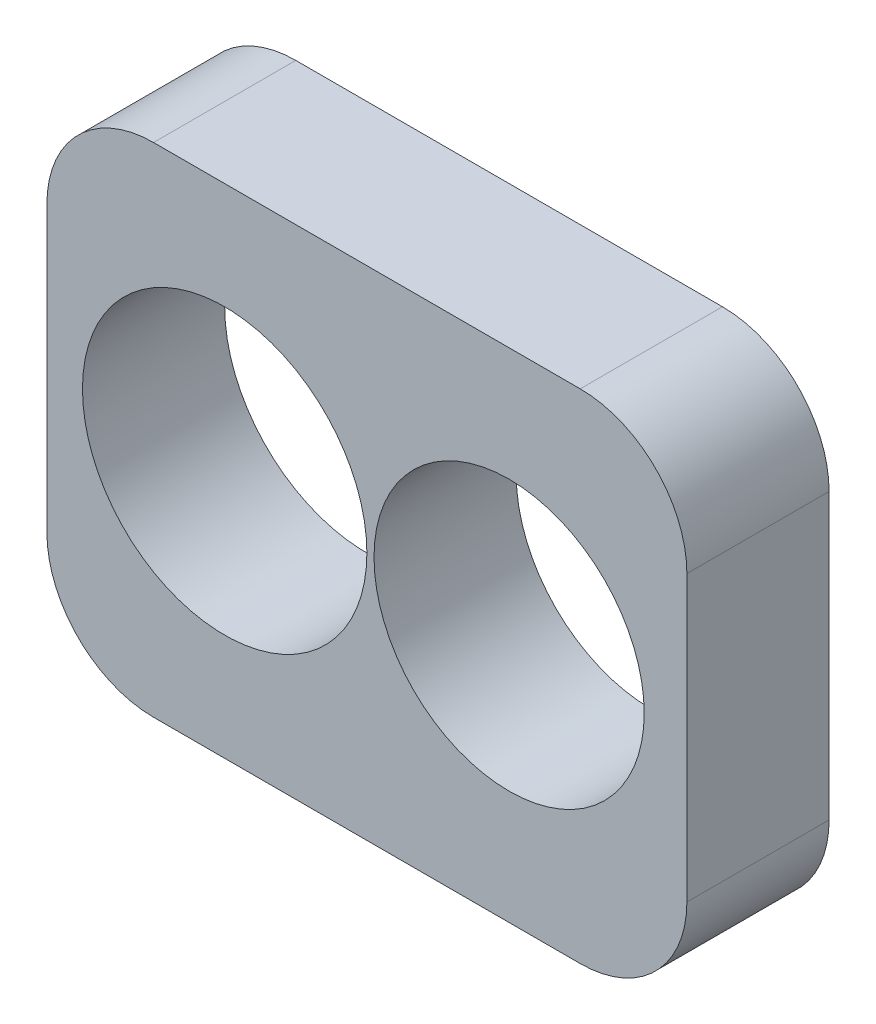
ISO-10303-21;
HEADER;
FILE_DESCRIPTION(('STEP AP214'),'2;1');
FILE_NAME('part.step','',(''),(''),'','','');
FILE_SCHEMA(('AUTOMOTIVE_DESIGN { 1 0 10303 214 1 1 1 1 }'));
ENDSEC;
DATA;
#1=APPLICATION_CONTEXT('core data for automotive mechanical design processes');
#2=APPLICATION_PROTOCOL_DEFINITION('international standard','automotive_design',2000,#1);
#3=PRODUCT_CONTEXT('',#1,'mechanical');
#4=PRODUCT('Part','Part','',(#3));
#5=PRODUCT_RELATED_PRODUCT_CATEGORY('part','',(#4));
#6=PRODUCT_DEFINITION_FORMATION('','',#4);
#7=PRODUCT_DEFINITION_CONTEXT('part definition',#1,'design');
#8=PRODUCT_DEFINITION('design','',#6,#7);
#9=PRODUCT_DEFINITION_SHAPE('','',#8);
#10=(LENGTH_UNIT() NAMED_UNIT(*) SI_UNIT(.MILLI.,.METRE.));
#11=(NAMED_UNIT(*) PLANE_ANGLE_UNIT() SI_UNIT($,.RADIAN.));
#12=(NAMED_UNIT(*) SI_UNIT($,.STERADIAN.) SOLID_ANGLE_UNIT());
#13=UNCERTAINTY_MEASURE_WITH_UNIT(LENGTH_MEASURE(1.E-05),#10,'distance_accuracy_value','');
#14=(GEOMETRIC_REPRESENTATION_CONTEXT(3) GLOBAL_UNCERTAINTY_ASSIGNED_CONTEXT((#13)) GLOBAL_UNIT_ASSIGNED_CONTEXT((#10,
#11,#12)) REPRESENTATION_CONTEXT('',''));
#15=CARTESIAN_POINT('',(0.,0.,0.));
#16=DIRECTION('',(0.,0.,1.));
#17=DIRECTION('',(1.,0.,0.));
#18=AXIS2_PLACEMENT_3D('',#15,#16,#17);
#19=CARTESIAN_POINT('',(-30.,-20.,20.));
#20=DIRECTION('',(0.,0.,-1.));
#21=DIRECTION('',(-1.,0.,0.));
#22=AXIS2_PLACEMENT_3D('',#19,#20,#21);
#23=CYLINDRICAL_SURFACE('',#22,15.);
#24=CARTESIAN_POINT('',(-30.,-20.,0.));
#25=DIRECTION('',(0.,0.,1.));
#26=DIRECTION('',(-1.,0.,0.));
#27=AXIS2_PLACEMENT_3D('',#24,#25,#26);
#28=CIRCLE('',#27,15.);
#29=CARTESIAN_POINT('',(-45.,-20.,0.));
#30=VERTEX_POINT('',#29);
#31=CARTESIAN_POINT('',(-30.,-35.,0.));
#32=VERTEX_POINT('',#31);
#33=EDGE_CURVE('E129',#30,#32,#28,.T.);
#34=ORIENTED_EDGE('',*,*,#33,.T.);
#35=DIRECTION('',(0.,0.,-1.));
#36=VECTOR('',#35,1.);
#37=CARTESIAN_POINT('',(-30.,-35.,20.));
#38=LINE('',#37,#36);
#39=CARTESIAN_POINT('',(-30.,-35.,20.));
#40=VERTEX_POINT('',#39);
#41=EDGE_CURVE('E11',#40,#32,#38,.T.);
#42=ORIENTED_EDGE('',*,*,#41,.F.);
#43=CARTESIAN_POINT('',(-30.,-20.,20.));
#44=DIRECTION('',(0.,0.,1.));
#45=DIRECTION('',(-1.,0.,0.));
#46=AXIS2_PLACEMENT_3D('',#43,#44,#45);
#47=CIRCLE('',#46,15.);
#48=CARTESIAN_POINT('',(-45.,-20.,20.));
#49=VERTEX_POINT('',#48);
#50=EDGE_CURVE('E144',#49,#40,#47,.T.);
#51=ORIENTED_EDGE('',*,*,#50,.F.);
#52=DIRECTION('',(0.,0.,-1.));
#53=VECTOR('',#52,1.);
#54=CARTESIAN_POINT('',(-45.,-20.,20.));
#55=LINE('',#54,#53);
#56=EDGE_CURVE('E125',#49,#30,#55,.T.);
#57=ORIENTED_EDGE('',*,*,#56,.T.);
#58=EDGE_LOOP('',(#34,#42,#51,#57));
#59=FACE_BOUND('',#58,.T.);
#60=ADVANCED_FACE('F33',(#59),#23,.T.);
#61=CARTESIAN_POINT('',(30.,-35.,20.));
#62=DIRECTION('',(0.,1.,0.));
#63=DIRECTION('',(-1.,0.,0.));
#64=AXIS2_PLACEMENT_3D('',#61,#62,#63);
#65=PLANE('',#64);
#66=DIRECTION('',(1.,0.,0.));
#67=VECTOR('',#66,1.);
#68=CARTESIAN_POINT('',(30.,-35.,0.));
#69=LINE('',#68,#67);
#70=CARTESIAN_POINT('',(30.,-35.,0.));
#71=VERTEX_POINT('',#70);
#72=EDGE_CURVE('E132',#32,#71,#69,.T.);
#73=ORIENTED_EDGE('',*,*,#72,.T.);
#74=DIRECTION('',(0.,0.,-1.));
#75=VECTOR('',#74,1.);
#76=CARTESIAN_POINT('',(30.,-35.,20.));
#77=LINE('',#76,#75);
#78=CARTESIAN_POINT('',(30.,-35.,20.));
#79=VERTEX_POINT('',#78);
#80=EDGE_CURVE('E41',#79,#71,#77,.T.);
#81=ORIENTED_EDGE('',*,*,#80,.F.);
#82=DIRECTION('',(1.,0.,0.));
#83=VECTOR('',#82,1.);
#84=CARTESIAN_POINT('',(30.,-35.,20.));
#85=LINE('',#84,#83);
#86=EDGE_CURVE('E92',#40,#79,#85,.T.);
#87=ORIENTED_EDGE('',*,*,#86,.F.);
#88=ORIENTED_EDGE('',*,*,#41,.T.);
#89=EDGE_LOOP('',(#73,#81,#87,#88));
#90=FACE_BOUND('',#89,.T.);
#91=ADVANCED_FACE('F213',(#90),#65,.F.);
#92=CARTESIAN_POINT('',(30.,-20.,20.));
#93=DIRECTION('',(0.,0.,-1.));
#94=DIRECTION('',(-1.,0.,0.));
#95=AXIS2_PLACEMENT_3D('',#92,#93,#94);
#96=CYLINDRICAL_SURFACE('',#95,15.);
#97=CARTESIAN_POINT('',(30.,-20.,0.));
#98=DIRECTION('',(0.,0.,1.));
#99=DIRECTION('',(1.,0.,0.));
#100=AXIS2_PLACEMENT_3D('',#97,#98,#99);
#101=CIRCLE('',#100,15.);
#102=CARTESIAN_POINT('',(45.,-20.,0.));
#103=VERTEX_POINT('',#102);
#104=EDGE_CURVE('E135',#71,#103,#101,.T.);
#105=ORIENTED_EDGE('',*,*,#104,.T.);
#106=DIRECTION('',(0.,0.,-1.));
#107=VECTOR('',#106,1.);
#108=CARTESIAN_POINT('',(45.,-20.,20.));
#109=LINE('',#108,#107);
#110=CARTESIAN_POINT('',(45.,-20.,20.));
#111=VERTEX_POINT('',#110);
#112=EDGE_CURVE('E151',#111,#103,#109,.T.);
#113=ORIENTED_EDGE('',*,*,#112,.F.);
#114=CARTESIAN_POINT('',(30.,-20.,20.));
#115=DIRECTION('',(0.,0.,1.));
#116=DIRECTION('',(1.,0.,0.));
#117=AXIS2_PLACEMENT_3D('',#114,#115,#116);
#118=CIRCLE('',#117,15.);
#119=EDGE_CURVE('E159',#79,#111,#118,.T.);
#120=ORIENTED_EDGE('',*,*,#119,.F.);
#121=ORIENTED_EDGE('',*,*,#80,.T.);
#122=EDGE_LOOP('',(#105,#113,#120,#121));
#123=FACE_BOUND('',#122,.T.);
#124=ADVANCED_FACE('F157',(#123),#96,.T.);
#125=CARTESIAN_POINT('',(45.,-20.,20.));
#126=DIRECTION('',(-1.,0.,0.));
#127=DIRECTION('',(0.,-1.,0.));
#128=AXIS2_PLACEMENT_3D('',#125,#126,#127);
#129=PLANE('',#128);
#130=DIRECTION('',(0.,1.,0.));
#131=VECTOR('',#130,1.);
#132=CARTESIAN_POINT('',(45.,-20.,0.));
#133=LINE('',#132,#131);
#134=CARTESIAN_POINT('',(45.,20.,0.));
#135=VERTEX_POINT('',#134);
#136=EDGE_CURVE('E137',#103,#135,#133,.T.);
#137=ORIENTED_EDGE('',*,*,#136,.T.);
#138=DIRECTION('',(0.,0.,-1.));
#139=VECTOR('',#138,1.);
#140=CARTESIAN_POINT('',(45.,20.,20.));
#141=LINE('',#140,#139);
#142=CARTESIAN_POINT('',(45.,20.,20.));
#143=VERTEX_POINT('',#142);
#144=EDGE_CURVE('E148',#143,#135,#141,.T.);
#145=ORIENTED_EDGE('',*,*,#144,.F.);
#146=DIRECTION('',(0.,1.,0.));
#147=VECTOR('',#146,1.);
#148=CARTESIAN_POINT('',(45.,-20.,20.));
#149=LINE('',#148,#147);
#150=EDGE_CURVE('E171',#111,#143,#149,.T.);
#151=ORIENTED_EDGE('',*,*,#150,.F.);
#152=ORIENTED_EDGE('',*,*,#112,.T.);
#153=EDGE_LOOP('',(#137,#145,#151,#152));
#154=FACE_BOUND('',#153,.T.);
#155=ADVANCED_FACE('F167',(#154),#129,.F.);
#156=CARTESIAN_POINT('',(30.,20.,20.));
#157=DIRECTION('',(0.,0.,-1.));
#158=DIRECTION('',(-1.,0.,0.));
#159=AXIS2_PLACEMENT_3D('',#156,#157,#158);
#160=CYLINDRICAL_SURFACE('',#159,15.);
#161=CARTESIAN_POINT('',(30.,20.,0.));
#162=DIRECTION('',(0.,0.,1.));
#163=DIRECTION('',(1.,0.,0.));
#164=AXIS2_PLACEMENT_3D('',#161,#162,#163);
#165=CIRCLE('',#164,15.);
#166=CARTESIAN_POINT('',(30.,35.,0.));
#167=VERTEX_POINT('',#166);
#168=EDGE_CURVE('E139',#135,#167,#165,.T.);
#169=ORIENTED_EDGE('',*,*,#168,.T.);
#170=DIRECTION('',(0.,0.,-1.));
#171=VECTOR('',#170,1.);
#172=CARTESIAN_POINT('',(30.,35.,20.));
#173=LINE('',#172,#171);
#174=CARTESIAN_POINT('',(30.,35.,20.));
#175=VERTEX_POINT('',#174);
#176=EDGE_CURVE('E120',#175,#167,#173,.T.);
#177=ORIENTED_EDGE('',*,*,#176,.F.);
#178=CARTESIAN_POINT('',(30.,20.,20.));
#179=DIRECTION('',(0.,0.,1.));
#180=DIRECTION('',(1.,0.,0.));
#181=AXIS2_PLACEMENT_3D('',#178,#179,#180);
#182=CIRCLE('',#181,15.);
#183=EDGE_CURVE('E111',#143,#175,#182,.T.);
#184=ORIENTED_EDGE('',*,*,#183,.F.);
#185=ORIENTED_EDGE('',*,*,#144,.T.);
#186=EDGE_LOOP('',(#169,#177,#184,#185));
#187=FACE_BOUND('',#186,.T.);
#188=ADVANCED_FACE('F170',(#187),#160,.T.);
#189=CARTESIAN_POINT('',(30.,35.,20.));
#190=DIRECTION('',(0.,-1.,0.));
#191=DIRECTION('',(0.,0.,-1.));
#192=AXIS2_PLACEMENT_3D('',#189,#190,#191);
#193=PLANE('',#192);
#194=DIRECTION('',(-1.,0.,0.));
#195=VECTOR('',#194,1.);
#196=CARTESIAN_POINT('',(30.,35.,0.));
#197=LINE('',#196,#195);
#198=CARTESIAN_POINT('',(-30.,35.,0.));
#199=VERTEX_POINT('',#198);
#200=EDGE_CURVE('E119',#167,#199,#197,.T.);
#201=ORIENTED_EDGE('',*,*,#200,.T.);
#202=DIRECTION('',(0.,0.,-1.));
#203=VECTOR('',#202,1.);
#204=CARTESIAN_POINT('',(-30.,35.,20.));
#205=LINE('',#204,#203);
#206=CARTESIAN_POINT('',(-30.,35.,20.));
#207=VERTEX_POINT('',#206);
#208=EDGE_CURVE('E116',#207,#199,#205,.T.);
#209=ORIENTED_EDGE('',*,*,#208,.F.);
#210=DIRECTION('',(-1.,0.,0.));
#211=VECTOR('',#210,1.);
#212=CARTESIAN_POINT('',(30.,35.,20.));
#213=LINE('',#212,#211);
#214=EDGE_CURVE('E105',#175,#207,#213,.T.);
#215=ORIENTED_EDGE('',*,*,#214,.F.);
#216=ORIENTED_EDGE('',*,*,#176,.T.);
#217=EDGE_LOOP('',(#201,#209,#215,#216));
#218=FACE_BOUND('',#217,.T.);
#219=ADVANCED_FACE('F117',(#218),#193,.F.);
#220=CARTESIAN_POINT('',(-30.,20.,20.));
#221=DIRECTION('',(0.,0.,-1.));
#222=DIRECTION('',(-1.,0.,0.));
#223=AXIS2_PLACEMENT_3D('',#220,#221,#222);
#224=CYLINDRICAL_SURFACE('',#223,15.);
#225=CARTESIAN_POINT('',(-30.,20.,0.));
#226=DIRECTION('',(0.,0.,1.));
#227=DIRECTION('',(-1.,0.,0.));
#228=AXIS2_PLACEMENT_3D('',#225,#226,#227);
#229=CIRCLE('',#228,15.);
#230=CARTESIAN_POINT('',(-45.,20.,0.));
#231=VERTEX_POINT('',#230);
#232=EDGE_CURVE('E78',#199,#231,#229,.T.);
#233=ORIENTED_EDGE('',*,*,#232,.T.);
#234=DIRECTION('',(0.,0.,-1.));
#235=VECTOR('',#234,1.);
#236=CARTESIAN_POINT('',(-45.,20.,20.));
#237=LINE('',#236,#235);
#238=CARTESIAN_POINT('',(-45.,20.,20.));
#239=VERTEX_POINT('',#238);
#240=EDGE_CURVE('E121',#239,#231,#237,.T.);
#241=ORIENTED_EDGE('',*,*,#240,.F.);
#242=CARTESIAN_POINT('',(-30.,20.,20.));
#243=DIRECTION('',(0.,0.,1.));
#244=DIRECTION('',(-1.,0.,0.));
#245=AXIS2_PLACEMENT_3D('',#242,#243,#244);
#246=CIRCLE('',#245,15.);
#247=EDGE_CURVE('E109',#207,#239,#246,.T.);
#248=ORIENTED_EDGE('',*,*,#247,.F.);
#249=ORIENTED_EDGE('',*,*,#208,.T.);
#250=EDGE_LOOP('',(#233,#241,#248,#249));
#251=FACE_BOUND('',#250,.T.);
#252=ADVANCED_FACE('F123',(#251),#224,.T.);
#253=CARTESIAN_POINT('',(-45.,-20.,20.));
#254=DIRECTION('',(1.,0.,0.));
#255=DIRECTION('',(0.,1.,0.));
#256=AXIS2_PLACEMENT_3D('',#253,#254,#255);
#257=PLANE('',#256);
#258=DIRECTION('',(0.,-1.,0.));
#259=VECTOR('',#258,1.);
#260=CARTESIAN_POINT('',(-45.,-20.,0.));
#261=LINE('',#260,#259);
#262=EDGE_CURVE('E84',#231,#30,#261,.T.);
#263=ORIENTED_EDGE('',*,*,#262,.T.);
#264=ORIENTED_EDGE('',*,*,#56,.F.);
#265=DIRECTION('',(0.,-1.,0.));
#266=VECTOR('',#265,1.);
#267=CARTESIAN_POINT('',(-45.,-20.,20.));
#268=LINE('',#267,#266);
#269=EDGE_CURVE('E49',#239,#49,#268,.T.);
#270=ORIENTED_EDGE('',*,*,#269,.F.);
#271=ORIENTED_EDGE('',*,*,#240,.T.);
#272=EDGE_LOOP('',(#263,#264,#270,#271));
#273=FACE_BOUND('',#272,.T.);
#274=ADVANCED_FACE('F200',(#273),#257,.F.);
#275=CARTESIAN_POINT('',(-30.,-20.,20.));
#276=DIRECTION('',(0.,0.,-1.));
#277=DIRECTION('',(-1.,0.,0.));
#278=AXIS2_PLACEMENT_3D('',#275,#276,#277);
#279=PLANE('',#278);
#280=CARTESIAN_POINT('',(20.,0.,20.));
#281=DIRECTION('',(0.,0.,1.));
#282=DIRECTION('',(1.,0.,0.));
#283=AXIS2_PLACEMENT_3D('',#280,#281,#282);
#284=CIRCLE('',#283,19.);
#285=CARTESIAN_POINT('',(39.,0.,20.));
#286=VERTEX_POINT('',#285);
#287=EDGE_CURVE('E183',#286,#286,#284,.T.);
#288=ORIENTED_EDGE('',*,*,#287,.F.);
#289=EDGE_LOOP('',(#288));
#290=FACE_BOUND('',#289,.T.);
#291=CARTESIAN_POINT('',(-20.,0.,20.));
#292=DIRECTION('',(0.,0.,-1.));
#293=DIRECTION('',(-1.,0.,0.));
#294=AXIS2_PLACEMENT_3D('',#291,#292,#293);
#295=CIRCLE('',#294,20.);
#296=CARTESIAN_POINT('',(-40.,0.,20.));
#297=VERTEX_POINT('',#296);
#298=EDGE_CURVE('E133',#297,#297,#295,.T.);
#299=ORIENTED_EDGE('',*,*,#298,.T.);
#300=EDGE_LOOP('',(#299));
#301=FACE_BOUND('',#300,.T.);
#302=ORIENTED_EDGE('',*,*,#50,.T.);
#303=ORIENTED_EDGE('',*,*,#86,.T.);
#304=ORIENTED_EDGE('',*,*,#119,.T.);
#305=ORIENTED_EDGE('',*,*,#150,.T.);
#306=ORIENTED_EDGE('',*,*,#183,.T.);
#307=ORIENTED_EDGE('',*,*,#214,.T.);
#308=ORIENTED_EDGE('',*,*,#247,.T.);
#309=ORIENTED_EDGE('',*,*,#269,.T.);
#310=EDGE_LOOP('',(#302,#303,#304,#305,#306,#307,#308,#309));
#311=FACE_BOUND('',#310,.T.);
#312=ADVANCED_FACE('F107',(#290,#301,#311),#279,.F.);
#313=CARTESIAN_POINT('',(-30.,-20.,0.));
#314=DIRECTION('',(0.,0.,-1.));
#315=DIRECTION('',(-1.,0.,0.));
#316=AXIS2_PLACEMENT_3D('',#313,#314,#315);
#317=PLANE('',#316);
#318=CARTESIAN_POINT('',(20.,0.,0.));
#319=DIRECTION('',(0.,0.,1.));
#320=DIRECTION('',(1.,0.,0.));
#321=AXIS2_PLACEMENT_3D('',#318,#319,#320);
#322=CIRCLE('',#321,19.);
#323=CARTESIAN_POINT('',(39.,0.,0.));
#324=VERTEX_POINT('',#323);
#325=EDGE_CURVE('E182',#324,#324,#322,.T.);
#326=ORIENTED_EDGE('',*,*,#325,.T.);
#327=EDGE_LOOP('',(#326));
#328=FACE_BOUND('',#327,.T.);
#329=CARTESIAN_POINT('',(-20.,0.,0.));
#330=DIRECTION('',(0.,0.,1.));
#331=DIRECTION('',(1.,0.,0.));
#332=AXIS2_PLACEMENT_3D('',#329,#330,#331);
#333=CIRCLE('',#332,20.);
#334=CARTESIAN_POINT('',(0.,0.,0.));
#335=VERTEX_POINT('',#334);
#336=EDGE_CURVE('E179',#335,#335,#333,.T.);
#337=ORIENTED_EDGE('',*,*,#336,.T.);
#338=EDGE_LOOP('',(#337));
#339=FACE_BOUND('',#338,.T.);
#340=ORIENTED_EDGE('',*,*,#33,.F.);
#341=ORIENTED_EDGE('',*,*,#262,.F.);
#342=ORIENTED_EDGE('',*,*,#232,.F.);
#343=ORIENTED_EDGE('',*,*,#200,.F.);
#344=ORIENTED_EDGE('',*,*,#168,.F.);
#345=ORIENTED_EDGE('',*,*,#136,.F.);
#346=ORIENTED_EDGE('',*,*,#104,.F.);
#347=ORIENTED_EDGE('',*,*,#72,.F.);
#348=EDGE_LOOP('',(#340,#341,#342,#343,#344,#345,#346,#347));
#349=FACE_BOUND('',#348,.T.);
#350=ADVANCED_FACE('F163',(#328,#339,#349),#317,.T.);
#351=CARTESIAN_POINT('',(-20.,0.,0.));
#352=DIRECTION('',(0.,0.,1.));
#353=DIRECTION('',(1.,0.,0.));
#354=AXIS2_PLACEMENT_3D('',#351,#352,#353);
#355=CYLINDRICAL_SURFACE('',#354,20.);
#356=ORIENTED_EDGE('',*,*,#336,.F.);
#357=EDGE_LOOP('',(#356));
#358=FACE_BOUND('',#357,.T.);
#359=ORIENTED_EDGE('',*,*,#298,.F.);
#360=EDGE_LOOP('',(#359));
#361=FACE_BOUND('',#360,.T.);
#362=ADVANCED_FACE('F194',(#358,#361),#355,.F.);
#363=CARTESIAN_POINT('',(20.,0.,0.));
#364=DIRECTION('',(0.,0.,1.));
#365=DIRECTION('',(1.,0.,0.));
#366=AXIS2_PLACEMENT_3D('',#363,#364,#365);
#367=CYLINDRICAL_SURFACE('',#366,19.);
#368=ORIENTED_EDGE('',*,*,#325,.F.);
#369=EDGE_LOOP('',(#368));
#370=FACE_BOUND('',#369,.T.);
#371=ORIENTED_EDGE('',*,*,#287,.T.);
#372=EDGE_LOOP('',(#371));
#373=FACE_BOUND('',#372,.T.);
#374=ADVANCED_FACE('F191',(#370,#373),#367,.F.);
#375=CLOSED_SHELL('',(#60,#91,#124,#155,#188,#219,#252,#274,#312,#350,#362,#374));
#376=MANIFOLD_SOLID_BREP('B2',#375);
#377=ADVANCED_BREP_SHAPE_REPRESENTATION('',(#18,#376),#14);
#378=SHAPE_DEFINITION_REPRESENTATION(#9,#377);
ENDSEC;
END-ISO-10303-21;
